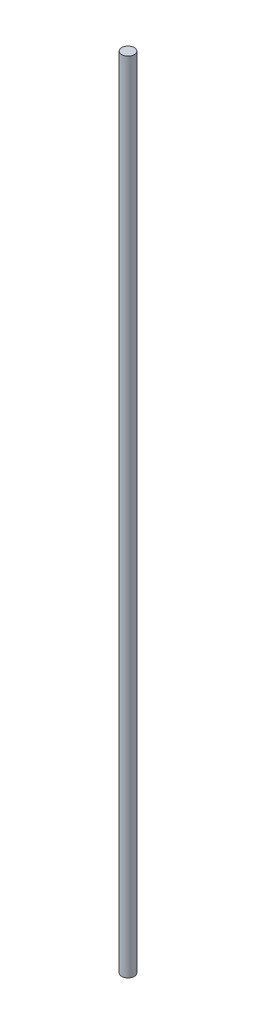
ISO-10303-21;
HEADER;
FILE_DESCRIPTION(('STEP AP214'),'2;1');
FILE_NAME('part.step','',(''),(''),'','','');
FILE_SCHEMA(('AUTOMOTIVE_DESIGN { 1 0 10303 214 1 1 1 1 }'));
ENDSEC;
DATA;
#1=APPLICATION_CONTEXT('core data for automotive mechanical design processes');
#2=APPLICATION_PROTOCOL_DEFINITION('international standard','automotive_design',2000,#1);
#3=PRODUCT_CONTEXT('',#1,'mechanical');
#4=PRODUCT('Part','Part','',(#3));
#5=PRODUCT_RELATED_PRODUCT_CATEGORY('part','',(#4));
#6=PRODUCT_DEFINITION_FORMATION('','',#4);
#7=PRODUCT_DEFINITION_CONTEXT('part definition',#1,'design');
#8=PRODUCT_DEFINITION('design','',#6,#7);
#9=PRODUCT_DEFINITION_SHAPE('','',#8);
#10=(LENGTH_UNIT() NAMED_UNIT(*) SI_UNIT(.MILLI.,.METRE.));
#11=(NAMED_UNIT(*) PLANE_ANGLE_UNIT() SI_UNIT($,.RADIAN.));
#12=(NAMED_UNIT(*) SI_UNIT($,.STERADIAN.) SOLID_ANGLE_UNIT());
#13=UNCERTAINTY_MEASURE_WITH_UNIT(LENGTH_MEASURE(1.E-05),#10,'distance_accuracy_value','');
#14=(GEOMETRIC_REPRESENTATION_CONTEXT(3) GLOBAL_UNCERTAINTY_ASSIGNED_CONTEXT((#13)) GLOBAL_UNIT_ASSIGNED_CONTEXT((#10,
#11,#12)) REPRESENTATION_CONTEXT('',''));
#15=CARTESIAN_POINT('',(0.,0.,0.));
#16=DIRECTION('',(0.,0.,1.));
#17=DIRECTION('',(1.,0.,0.));
#18=AXIS2_PLACEMENT_3D('',#15,#16,#17);
#19=CARTESIAN_POINT('',(0.,2438.4,0.));
#20=DIRECTION('',(0.,-1.,0.));
#21=DIRECTION('',(0.,0.,-1.));
#22=AXIS2_PLACEMENT_3D('',#19,#20,#21);
#23=CYLINDRICAL_SURFACE('',#22,19.05);
#24=CARTESIAN_POINT('',(0.,2438.4,0.));
#25=DIRECTION('',(0.,1.,0.));
#26=DIRECTION('',(0.,0.,1.));
#27=AXIS2_PLACEMENT_3D('',#24,#25,#26);
#28=CIRCLE('',#27,19.05);
#29=CARTESIAN_POINT('',(0.,2438.4,19.05));
#30=VERTEX_POINT('',#29);
#31=EDGE_CURVE('E10',#30,#30,#28,.T.);
#32=ORIENTED_EDGE('',*,*,#31,.F.);
#33=EDGE_LOOP('',(#32));
#34=FACE_BOUND('',#33,.T.);
#35=CARTESIAN_POINT('',(0.,0.,0.));
#36=DIRECTION('',(0.,1.,0.));
#37=DIRECTION('',(0.,0.,1.));
#38=AXIS2_PLACEMENT_3D('',#35,#36,#37);
#39=CIRCLE('',#38,19.05);
#40=CARTESIAN_POINT('',(0.,0.,19.05));
#41=VERTEX_POINT('',#40);
#42=EDGE_CURVE('E34',#41,#41,#39,.T.);
#43=ORIENTED_EDGE('',*,*,#42,.T.);
#44=EDGE_LOOP('',(#43));
#45=FACE_BOUND('',#44,.T.);
#46=ADVANCED_FACE('F31',(#34,#45),#23,.T.);
#47=CARTESIAN_POINT('',(0.,2438.4,0.));
#48=DIRECTION('',(0.,1.,0.));
#49=DIRECTION('',(0.,0.,1.));
#50=AXIS2_PLACEMENT_3D('',#47,#48,#49);
#51=PLANE('',#50);
#52=ORIENTED_EDGE('',*,*,#31,.T.);
#53=EDGE_LOOP('',(#52));
#54=FACE_BOUND('',#53,.T.);
#55=ADVANCED_FACE('F46',(#54),#51,.T.);
#56=CARTESIAN_POINT('',(0.,0.,0.));
#57=DIRECTION('',(0.,1.,0.));
#58=DIRECTION('',(0.,0.,1.));
#59=AXIS2_PLACEMENT_3D('',#56,#57,#58);
#60=PLANE('',#59);
#61=ORIENTED_EDGE('',*,*,#42,.F.);
#62=EDGE_LOOP('',(#61));
#63=FACE_BOUND('',#62,.T.);
#64=ADVANCED_FACE('F44',(#63),#60,.F.);
#65=CLOSED_SHELL('',(#46,#55,#64));
#66=MANIFOLD_SOLID_BREP('B2',#65);
#67=ADVANCED_BREP_SHAPE_REPRESENTATION('',(#18,#66),#14);
#68=SHAPE_DEFINITION_REPRESENTATION(#9,#67);
ENDSEC;
END-ISO-10303-21;
